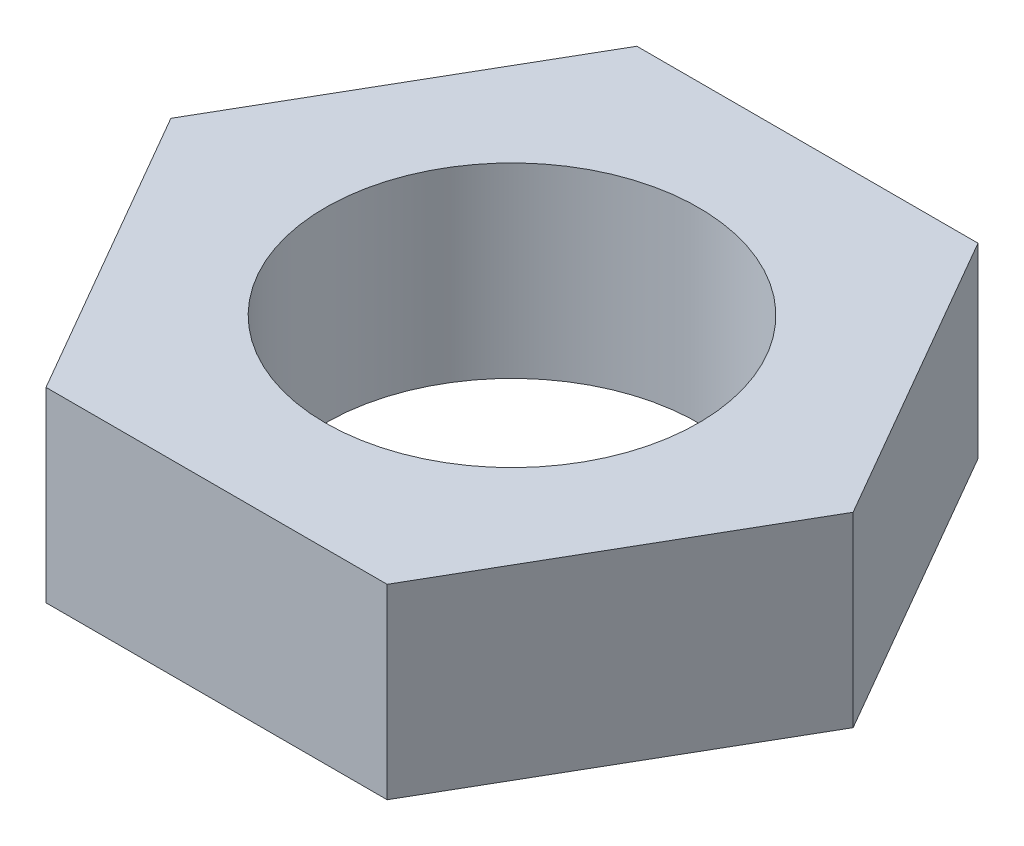
ISO-10303-21;
HEADER;
FILE_DESCRIPTION(('STEP AP214'),'2;1');
FILE_NAME('part.step','',(''),(''),'','','');
FILE_SCHEMA(('AUTOMOTIVE_DESIGN { 1 0 10303 214 1 1 1 1 }'));
ENDSEC;
DATA;
#1=APPLICATION_CONTEXT('core data for automotive mechanical design processes');
#2=APPLICATION_PROTOCOL_DEFINITION('international standard','automotive_design',2000,#1);
#3=PRODUCT_CONTEXT('',#1,'mechanical');
#4=PRODUCT('Part','Part','',(#3));
#5=PRODUCT_RELATED_PRODUCT_CATEGORY('part','',(#4));
#6=PRODUCT_DEFINITION_FORMATION('','',#4);
#7=PRODUCT_DEFINITION_CONTEXT('part definition',#1,'design');
#8=PRODUCT_DEFINITION('design','',#6,#7);
#9=PRODUCT_DEFINITION_SHAPE('','',#8);
#10=(LENGTH_UNIT() NAMED_UNIT(*) SI_UNIT(.MILLI.,.METRE.));
#11=(NAMED_UNIT(*) PLANE_ANGLE_UNIT() SI_UNIT($,.RADIAN.));
#12=(NAMED_UNIT(*) SI_UNIT($,.STERADIAN.) SOLID_ANGLE_UNIT());
#13=UNCERTAINTY_MEASURE_WITH_UNIT(LENGTH_MEASURE(1.E-05),#10,'distance_accuracy_value','');
#14=(GEOMETRIC_REPRESENTATION_CONTEXT(3) GLOBAL_UNCERTAINTY_ASSIGNED_CONTEXT((#13)) GLOBAL_UNIT_ASSIGNED_CONTEXT((#10,
#11,#12)) REPRESENTATION_CONTEXT('',''));
#15=CARTESIAN_POINT('',(0.,0.,0.));
#16=DIRECTION('',(0.,0.,1.));
#17=DIRECTION('',(1.,0.,0.));
#18=AXIS2_PLACEMENT_3D('',#15,#16,#17);
#19=CARTESIAN_POINT('',(5.48482755730157,-6.,9.49999999999996));
#20=DIRECTION('',(0.866025403784441,0.,0.499999999999995));
#21=DIRECTION('',(0.499999999999995,0.,-0.866025403784442));
#22=AXIS2_PLACEMENT_3D('',#19,#20,#21);
#23=PLANE('',#22);
#24=DIRECTION('',(0.499999999999995,0.,-0.866025403784442));
#25=VECTOR('',#24,1.);
#26=CARTESIAN_POINT('',(5.48482755730157,0.,9.49999999999996));
#27=LINE('',#26,#25);
#28=CARTESIAN_POINT('',(5.48482755730157,0.,9.49999999999996));
#29=VERTEX_POINT('',#28);
#30=CARTESIAN_POINT('',(10.9696551146029,0.,0.));
#31=VERTEX_POINT('',#30);
#32=EDGE_CURVE('E131',#29,#31,#27,.T.);
#33=ORIENTED_EDGE('',*,*,#32,.F.);
#34=DIRECTION('',(0.,1.,0.));
#35=VECTOR('',#34,1.);
#36=CARTESIAN_POINT('',(5.48482755730157,-6.,9.49999999999996));
#37=LINE('',#36,#35);
#38=CARTESIAN_POINT('',(5.48482755730157,-6.,9.49999999999996));
#39=VERTEX_POINT('',#38);
#40=EDGE_CURVE('E13',#39,#29,#37,.T.);
#41=ORIENTED_EDGE('',*,*,#40,.F.);
#42=DIRECTION('',(0.499999999999995,0.,-0.866025403784442));
#43=VECTOR('',#42,1.);
#44=CARTESIAN_POINT('',(5.48482755730157,-6.,9.49999999999996));
#45=LINE('',#44,#43);
#46=CARTESIAN_POINT('',(10.9696551146029,-6.,0.));
#47=VERTEX_POINT('',#46);
#48=EDGE_CURVE('E146',#39,#47,#45,.T.);
#49=ORIENTED_EDGE('',*,*,#48,.T.);
#50=DIRECTION('',(0.,1.,0.));
#51=VECTOR('',#50,1.);
#52=CARTESIAN_POINT('',(10.9696551146029,-6.,0.));
#53=LINE('',#52,#51);
#54=EDGE_CURVE('E49',#47,#31,#53,.T.);
#55=ORIENTED_EDGE('',*,*,#54,.T.);
#56=EDGE_LOOP('',(#33,#41,#49,#55));
#57=FACE_BOUND('',#56,.T.);
#58=ADVANCED_FACE('F46',(#57),#23,.T.);
#59=CARTESIAN_POINT('',(-5.48482755730137,-6.,9.50000000000007));
#60=DIRECTION('',(0.,0.,1.));
#61=DIRECTION('',(1.,0.,0.));
#62=AXIS2_PLACEMENT_3D('',#59,#60,#61);
#63=PLANE('',#62);
#64=DIRECTION('',(1.,0.,0.));
#65=VECTOR('',#64,1.);
#66=CARTESIAN_POINT('',(-5.48482755730137,0.,9.50000000000007));
#67=LINE('',#66,#65);
#68=CARTESIAN_POINT('',(-5.48482755730137,0.,9.50000000000007));
#69=VERTEX_POINT('',#68);
#70=EDGE_CURVE('E144',#69,#29,#67,.T.);
#71=ORIENTED_EDGE('',*,*,#70,.F.);
#72=DIRECTION('',(0.,1.,0.));
#73=VECTOR('',#72,1.);
#74=CARTESIAN_POINT('',(-5.48482755730137,-6.,9.50000000000007));
#75=LINE('',#74,#73);
#76=CARTESIAN_POINT('',(-5.48482755730137,-6.,9.50000000000007));
#77=VERTEX_POINT('',#76);
#78=EDGE_CURVE('E55',#77,#69,#75,.T.);
#79=ORIENTED_EDGE('',*,*,#78,.F.);
#80=DIRECTION('',(1.,0.,0.));
#81=VECTOR('',#80,1.);
#82=CARTESIAN_POINT('',(-5.48482755730137,-6.,9.50000000000007));
#83=LINE('',#82,#81);
#84=EDGE_CURVE('E121',#77,#39,#83,.T.);
#85=ORIENTED_EDGE('',*,*,#84,.T.);
#86=ORIENTED_EDGE('',*,*,#40,.T.);
#87=EDGE_LOOP('',(#71,#79,#85,#86));
#88=FACE_BOUND('',#87,.T.);
#89=ADVANCED_FACE('F154',(#88),#63,.T.);
#90=CARTESIAN_POINT('',(-10.9696551146029,-6.,0.));
#91=DIRECTION('',(-0.866025403784434,0.,0.500000000000007));
#92=DIRECTION('',(0.500000000000007,0.,0.866025403784435));
#93=AXIS2_PLACEMENT_3D('',#90,#91,#92);
#94=PLANE('',#93);
#95=DIRECTION('',(0.500000000000007,0.,0.866025403784435));
#96=VECTOR('',#95,1.);
#97=CARTESIAN_POINT('',(-10.9696551146029,0.,0.));
#98=LINE('',#97,#96);
#99=CARTESIAN_POINT('',(-10.9696551146029,0.,0.));
#100=VERTEX_POINT('',#99);
#101=EDGE_CURVE('E108',#100,#69,#98,.T.);
#102=ORIENTED_EDGE('',*,*,#101,.F.);
#103=DIRECTION('',(0.,1.,0.));
#104=VECTOR('',#103,1.);
#105=CARTESIAN_POINT('',(-10.9696551146029,-6.,0.));
#106=LINE('',#105,#104);
#107=CARTESIAN_POINT('',(-10.9696551146029,-6.,0.));
#108=VERTEX_POINT('',#107);
#109=EDGE_CURVE('E103',#108,#100,#106,.T.);
#110=ORIENTED_EDGE('',*,*,#109,.F.);
#111=DIRECTION('',(0.500000000000007,0.,0.866025403784435));
#112=VECTOR('',#111,1.);
#113=CARTESIAN_POINT('',(-10.9696551146029,-6.,0.));
#114=LINE('',#113,#112);
#115=EDGE_CURVE('E106',#108,#77,#114,.T.);
#116=ORIENTED_EDGE('',*,*,#115,.T.);
#117=ORIENTED_EDGE('',*,*,#78,.T.);
#118=EDGE_LOOP('',(#102,#110,#116,#117));
#119=FACE_BOUND('',#118,.T.);
#120=ADVANCED_FACE('F105',(#119),#94,.T.);
#121=CARTESIAN_POINT('',(-5.4848275573015,-6.,-9.5));
#122=DIRECTION('',(-0.866025403784441,0.,-0.499999999999995));
#123=DIRECTION('',(-0.499999999999995,0.,0.866025403784442));
#124=AXIS2_PLACEMENT_3D('',#121,#122,#123);
#125=PLANE('',#124);
#126=DIRECTION('',(-0.499999999999995,0.,0.866025403784442));
#127=VECTOR('',#126,1.);
#128=CARTESIAN_POINT('',(-5.4848275573015,0.,-9.5));
#129=LINE('',#128,#127);
#130=CARTESIAN_POINT('',(-5.4848275573015,0.,-9.5));
#131=VERTEX_POINT('',#130);
#132=EDGE_CURVE('E141',#131,#100,#129,.T.);
#133=ORIENTED_EDGE('',*,*,#132,.F.);
#134=DIRECTION('',(0.,1.,0.));
#135=VECTOR('',#134,1.);
#136=CARTESIAN_POINT('',(-5.4848275573015,-6.,-9.5));
#137=LINE('',#136,#135);
#138=CARTESIAN_POINT('',(-5.4848275573015,-6.,-9.5));
#139=VERTEX_POINT('',#138);
#140=EDGE_CURVE('E113',#139,#131,#137,.T.);
#141=ORIENTED_EDGE('',*,*,#140,.F.);
#142=DIRECTION('',(-0.499999999999995,0.,0.866025403784442));
#143=VECTOR('',#142,1.);
#144=CARTESIAN_POINT('',(-5.4848275573015,-6.,-9.5));
#145=LINE('',#144,#143);
#146=EDGE_CURVE('E119',#139,#108,#145,.T.);
#147=ORIENTED_EDGE('',*,*,#146,.T.);
#148=ORIENTED_EDGE('',*,*,#109,.T.);
#149=EDGE_LOOP('',(#133,#141,#147,#148));
#150=FACE_BOUND('',#149,.T.);
#151=ADVANCED_FACE('F123',(#150),#125,.T.);
#152=CARTESIAN_POINT('',(5.48482755730144,-6.,-9.50000000000004));
#153=DIRECTION('',(0.,0.,-1.));
#154=DIRECTION('',(-1.,0.,0.));
#155=AXIS2_PLACEMENT_3D('',#152,#153,#154);
#156=PLANE('',#155);
#157=DIRECTION('',(-1.,0.,0.));
#158=VECTOR('',#157,1.);
#159=CARTESIAN_POINT('',(5.48482755730144,0.,-9.50000000000004));
#160=LINE('',#159,#158);
#161=CARTESIAN_POINT('',(5.48482755730144,0.,-9.50000000000004));
#162=VERTEX_POINT('',#161);
#163=EDGE_CURVE('E138',#162,#131,#160,.T.);
#164=ORIENTED_EDGE('',*,*,#163,.F.);
#165=DIRECTION('',(0.,1.,0.));
#166=VECTOR('',#165,1.);
#167=CARTESIAN_POINT('',(5.48482755730144,-6.,-9.50000000000004));
#168=LINE('',#167,#166);
#169=CARTESIAN_POINT('',(5.48482755730144,-6.,-9.50000000000004));
#170=VERTEX_POINT('',#169);
#171=EDGE_CURVE('E149',#170,#162,#168,.T.);
#172=ORIENTED_EDGE('',*,*,#171,.F.);
#173=DIRECTION('',(-1.,0.,0.));
#174=VECTOR('',#173,1.);
#175=CARTESIAN_POINT('',(5.48482755730144,-6.,-9.50000000000004));
#176=LINE('',#175,#174);
#177=EDGE_CURVE('E124',#170,#139,#176,.T.);
#178=ORIENTED_EDGE('',*,*,#177,.T.);
#179=ORIENTED_EDGE('',*,*,#140,.T.);
#180=EDGE_LOOP('',(#164,#172,#178,#179));
#181=FACE_BOUND('',#180,.T.);
#182=ADVANCED_FACE('F167',(#181),#156,.T.);
#183=CARTESIAN_POINT('',(10.9696551146029,-6.,0.));
#184=DIRECTION('',(0.866025403784438,0.,-0.500000000000001));
#185=DIRECTION('',(-0.500000000000001,0.,-0.866025403784438));
#186=AXIS2_PLACEMENT_3D('',#183,#184,#185);
#187=PLANE('',#186);
#188=DIRECTION('',(-0.500000000000001,0.,-0.866025403784438));
#189=VECTOR('',#188,1.);
#190=CARTESIAN_POINT('',(10.9696551146029,0.,0.));
#191=LINE('',#190,#189);
#192=EDGE_CURVE('E134',#31,#162,#191,.T.);
#193=ORIENTED_EDGE('',*,*,#192,.F.);
#194=ORIENTED_EDGE('',*,*,#54,.F.);
#195=DIRECTION('',(-0.500000000000001,0.,-0.866025403784438));
#196=VECTOR('',#195,1.);
#197=CARTESIAN_POINT('',(10.9696551146029,-6.,0.));
#198=LINE('',#197,#196);
#199=EDGE_CURVE('E126',#47,#170,#198,.T.);
#200=ORIENTED_EDGE('',*,*,#199,.T.);
#201=ORIENTED_EDGE('',*,*,#171,.T.);
#202=EDGE_LOOP('',(#193,#194,#200,#201));
#203=FACE_BOUND('',#202,.T.);
#204=ADVANCED_FACE('F151',(#203),#187,.T.);
#205=CARTESIAN_POINT('',(0.,-6.,0.));
#206=DIRECTION('',(0.,1.,0.));
#207=DIRECTION('',(0.,0.,1.));
#208=AXIS2_PLACEMENT_3D('',#205,#206,#207);
#209=PLANE('',#208);
#210=CARTESIAN_POINT('',(0.,-6.,0.));
#211=DIRECTION('',(0.,1.,0.));
#212=DIRECTION('',(0.,0.,1.));
#213=AXIS2_PLACEMENT_3D('',#210,#211,#212);
#214=CIRCLE('',#213,6.);
#215=CARTESIAN_POINT('',(0.,-6.,6.));
#216=VERTEX_POINT('',#215);
#217=EDGE_CURVE('E135',#216,#216,#214,.T.);
#218=ORIENTED_EDGE('',*,*,#217,.T.);
#219=EDGE_LOOP('',(#218));
#220=FACE_BOUND('',#219,.T.);
#221=ORIENTED_EDGE('',*,*,#48,.F.);
#222=ORIENTED_EDGE('',*,*,#84,.F.);
#223=ORIENTED_EDGE('',*,*,#115,.F.);
#224=ORIENTED_EDGE('',*,*,#146,.F.);
#225=ORIENTED_EDGE('',*,*,#177,.F.);
#226=ORIENTED_EDGE('',*,*,#199,.F.);
#227=EDGE_LOOP('',(#221,#222,#223,#224,#225,#226));
#228=FACE_BOUND('',#227,.T.);
#229=ADVANCED_FACE('F117',(#220,#228),#209,.F.);
#230=CARTESIAN_POINT('',(0.,0.,0.));
#231=DIRECTION('',(0.,1.,0.));
#232=DIRECTION('',(0.,0.,1.));
#233=AXIS2_PLACEMENT_3D('',#230,#231,#232);
#234=PLANE('',#233);
#235=CARTESIAN_POINT('',(0.,0.,0.));
#236=DIRECTION('',(0.,1.,0.));
#237=DIRECTION('',(0.,0.,1.));
#238=AXIS2_PLACEMENT_3D('',#235,#236,#237);
#239=CIRCLE('',#238,6.);
#240=CARTESIAN_POINT('',(0.,0.,6.));
#241=VERTEX_POINT('',#240);
#242=EDGE_CURVE('E190',#241,#241,#239,.T.);
#243=ORIENTED_EDGE('',*,*,#242,.F.);
#244=EDGE_LOOP('',(#243));
#245=FACE_BOUND('',#244,.T.);
#246=ORIENTED_EDGE('',*,*,#32,.T.);
#247=ORIENTED_EDGE('',*,*,#192,.T.);
#248=ORIENTED_EDGE('',*,*,#163,.T.);
#249=ORIENTED_EDGE('',*,*,#132,.T.);
#250=ORIENTED_EDGE('',*,*,#101,.T.);
#251=ORIENTED_EDGE('',*,*,#70,.T.);
#252=EDGE_LOOP('',(#246,#247,#248,#249,#250,#251));
#253=FACE_BOUND('',#252,.T.);
#254=ADVANCED_FACE('F153',(#245,#253),#234,.T.);
#255=CARTESIAN_POINT('',(0.,-6.,0.));
#256=DIRECTION('',(0.,1.,0.));
#257=DIRECTION('',(0.,0.,1.));
#258=AXIS2_PLACEMENT_3D('',#255,#256,#257);
#259=CYLINDRICAL_SURFACE('',#258,6.);
#260=ORIENTED_EDGE('',*,*,#217,.F.);
#261=EDGE_LOOP('',(#260));
#262=FACE_BOUND('',#261,.T.);
#263=ORIENTED_EDGE('',*,*,#242,.T.);
#264=EDGE_LOOP('',(#263));
#265=FACE_BOUND('',#264,.T.);
#266=ADVANCED_FACE('F178',(#262,#265),#259,.F.);
#267=CLOSED_SHELL('',(#58,#89,#120,#151,#182,#204,#229,#254,#266));
#268=MANIFOLD_SOLID_BREP('B2',#267);
#269=ADVANCED_BREP_SHAPE_REPRESENTATION('',(#18,#268),#14);
#270=SHAPE_DEFINITION_REPRESENTATION(#9,#269);
ENDSEC;
END-ISO-10303-21;
